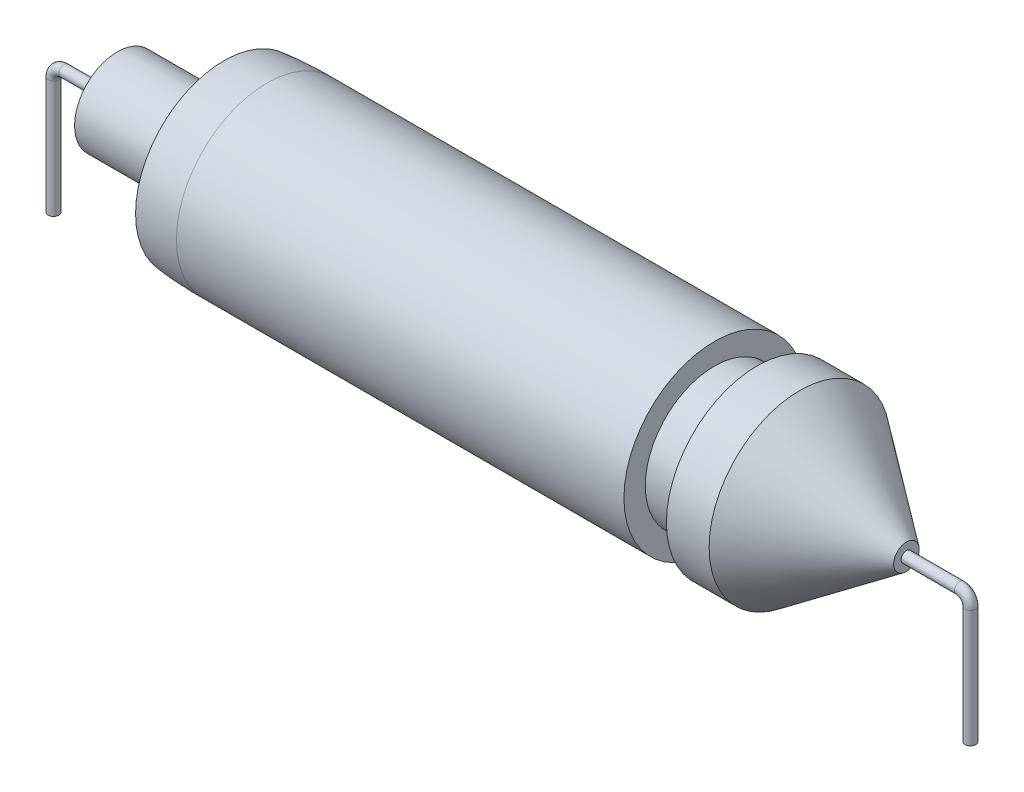
ISO-10303-21;
HEADER;
FILE_DESCRIPTION(('STEP AP214'),'2;1');
FILE_NAME('part.step','',(''),(''),'','','');
FILE_SCHEMA(('AUTOMOTIVE_DESIGN { 1 0 10303 214 1 1 1 1 }'));
ENDSEC;
DATA;
#1=APPLICATION_CONTEXT('core data for automotive mechanical design processes');
#2=APPLICATION_PROTOCOL_DEFINITION('international standard','automotive_design',2000,#1);
#3=PRODUCT_CONTEXT('',#1,'mechanical');
#4=PRODUCT('Part','Part','',(#3));
#5=PRODUCT_RELATED_PRODUCT_CATEGORY('part','',(#4));
#6=PRODUCT_DEFINITION_FORMATION('','',#4);
#7=PRODUCT_DEFINITION_CONTEXT('part definition',#1,'design');
#8=PRODUCT_DEFINITION('design','',#6,#7);
#9=PRODUCT_DEFINITION_SHAPE('','',#8);
#10=(LENGTH_UNIT() NAMED_UNIT(*) SI_UNIT(.MILLI.,.METRE.));
#11=(NAMED_UNIT(*) PLANE_ANGLE_UNIT() SI_UNIT($,.RADIAN.));
#12=(NAMED_UNIT(*) SI_UNIT($,.STERADIAN.) SOLID_ANGLE_UNIT());
#13=UNCERTAINTY_MEASURE_WITH_UNIT(LENGTH_MEASURE(1.E-05),#10,'distance_accuracy_value','');
#14=(GEOMETRIC_REPRESENTATION_CONTEXT(3) GLOBAL_UNCERTAINTY_ASSIGNED_CONTEXT((#13)) GLOBAL_UNIT_ASSIGNED_CONTEXT((#10,
#11,#12)) REPRESENTATION_CONTEXT('',''));
#15=CARTESIAN_POINT('',(0.,0.,0.));
#16=DIRECTION('',(0.,0.,1.));
#17=DIRECTION('',(1.,0.,0.));
#18=AXIS2_PLACEMENT_3D('',#15,#16,#17);
#19=CARTESIAN_POINT('',(21854.0017258238,-6000.,0.));
#20=DIRECTION('',(0.,1.,0.));
#21=DIRECTION('',(0.,0.,1.));
#22=AXIS2_PLACEMENT_3D('',#19,#20,#21);
#23=PLANE('',#22);
#24=CARTESIAN_POINT('',(21854.0017258238,-6000.,0.));
#25=DIRECTION('',(0.,1.,0.));
#26=DIRECTION('',(0.,0.,1.));
#27=AXIS2_PLACEMENT_3D('',#24,#25,#26);
#28=CIRCLE('',#27,250.);
#29=CARTESIAN_POINT('',(21854.0017258238,-6000.,250.));
#30=VERTEX_POINT('',#29);
#31=EDGE_CURVE('E67',#30,#30,#28,.T.);
#32=ORIENTED_EDGE('',*,*,#31,.F.);
#33=EDGE_LOOP('',(#32));
#34=FACE_BOUND('',#33,.T.);
#35=ADVANCED_FACE('F61',(#34),#23,.F.);
#36=CARTESIAN_POINT('',(18854.0017258238,0.,0.));
#37=DIRECTION('',(1.,0.,0.));
#38=DIRECTION('',(0.,0.,-1.));
#39=AXIS2_PLACEMENT_3D('',#36,#37,#38);
#40=CYLINDRICAL_SURFACE('',#39,250.);
#41=CARTESIAN_POINT('',(21354.0017258238,0.,0.));
#42=DIRECTION('',(-1.,0.,0.));
#43=DIRECTION('',(0.,0.,1.));
#44=AXIS2_PLACEMENT_3D('',#41,#42,#43);
#45=CIRCLE('',#44,250.);
#46=CARTESIAN_POINT('',(21354.0017258238,250.,0.));
#47=VERTEX_POINT('',#46);
#48=EDGE_CURVE('E75',#47,#47,#45,.T.);
#49=ORIENTED_EDGE('',*,*,#48,.T.);
#50=EDGE_LOOP('',(#49));
#51=FACE_BOUND('',#50,.T.);
#52=CARTESIAN_POINT('',(18854.0017258238,0.,0.));
#53=DIRECTION('',(-1.,0.,0.));
#54=DIRECTION('',(0.,0.,1.));
#55=AXIS2_PLACEMENT_3D('',#52,#53,#54);
#56=CIRCLE('',#55,250.);
#57=CARTESIAN_POINT('',(18854.0017258238,0.,250.));
#58=VERTEX_POINT('',#57);
#59=EDGE_CURVE('E80',#58,#58,#56,.T.);
#60=ORIENTED_EDGE('',*,*,#59,.F.);
#61=EDGE_LOOP('',(#60));
#62=FACE_BOUND('',#61,.T.);
#63=ADVANCED_FACE('F143',(#51,#62),#40,.T.);
#64=CARTESIAN_POINT('',(21354.0017258238,-500.,0.));
#65=DIRECTION('',(0.,0.,-1.));
#66=DIRECTION('',(-1.,0.,0.));
#67=AXIS2_PLACEMENT_3D('',#64,#65,#66);
#68=TOROIDAL_SURFACE('',#67,500.,250.);
#69=CARTESIAN_POINT('',(21854.0017258238,-500.,0.));
#70=DIRECTION('',(0.,1.,0.));
#71=DIRECTION('',(0.,0.,1.));
#72=AXIS2_PLACEMENT_3D('',#69,#70,#71);
#73=CIRCLE('',#72,250.);
#74=CARTESIAN_POINT('',(22104.0017258238,-500.,0.));
#75=VERTEX_POINT('',#74);
#76=EDGE_CURVE('E71',#75,#75,#73,.T.);
#77=CARTESIAN_POINT('',(21354.0017258238,-500.,0.));
#78=DIRECTION('',(0.,0.,-1.));
#79=DIRECTION('',(-1.,0.,0.));
#80=AXIS2_PLACEMENT_3D('',#77,#78,#79);
#81=CIRCLE('',#80,750.);
#82=EDGE_CURVE('',#47,#75,#81,.T.);
#83=ORIENTED_EDGE('',*,*,#48,.F.);
#84=ORIENTED_EDGE('',*,*,#76,.T.);
#85=ORIENTED_EDGE('',*,*,#82,.T.);
#86=ORIENTED_EDGE('',*,*,#82,.F.);
#87=EDGE_LOOP('',(#83,#85,#84,#86));
#88=FACE_BOUND('',#87,.T.);
#89=ADVANCED_FACE('F146',(#88),#68,.T.);
#90=CARTESIAN_POINT('',(21854.0017258238,-500.,0.));
#91=DIRECTION('',(0.,-1.,0.));
#92=DIRECTION('',(0.,0.,-1.));
#93=AXIS2_PLACEMENT_3D('',#90,#91,#92);
#94=CYLINDRICAL_SURFACE('',#93,250.);
#95=ORIENTED_EDGE('',*,*,#31,.T.);
#96=EDGE_LOOP('',(#95));
#97=FACE_BOUND('',#96,.T.);
#98=ORIENTED_EDGE('',*,*,#76,.F.);
#99=EDGE_LOOP('',(#98));
#100=FACE_BOUND('',#99,.T.);
#101=ADVANCED_FACE('F141',(#97,#100),#94,.T.);
#102=CARTESIAN_POINT('',(-18134.91260846,0.,0.));
#103=DIRECTION('',(1.,0.,0.));
#104=DIRECTION('',(0.,0.,-1.));
#105=AXIS2_PLACEMENT_3D('',#102,#103,#104);
#106=PLANE('',#105);
#107=CARTESIAN_POINT('',(-18134.91260846,-1.06581410364015E-11,0.));
#108=DIRECTION('',(1.,0.,0.));
#109=DIRECTION('',(0.,0.,-1.));
#110=AXIS2_PLACEMENT_3D('',#107,#108,#109);
#111=CIRCLE('',#110,250.);
#112=CARTESIAN_POINT('',(-18134.91260846,-1.06581410364015E-11,-250.));
#113=VERTEX_POINT('',#112);
#114=EDGE_CURVE('E11',#113,#113,#111,.F.);
#115=ORIENTED_EDGE('',*,*,#114,.F.);
#116=EDGE_LOOP('',(#115));
#117=FACE_BOUND('',#116,.T.);
#118=CARTESIAN_POINT('',(-18134.91260846,0.,0.));
#119=DIRECTION('',(-1.,0.,0.));
#120=DIRECTION('',(0.,0.,1.));
#121=AXIS2_PLACEMENT_3D('',#118,#119,#120);
#122=CIRCLE('',#121,2000.00000000001);
#123=CARTESIAN_POINT('',(-18134.91260846,0.,2000.00000000001));
#124=VERTEX_POINT('',#123);
#125=EDGE_CURVE('E83',#124,#124,#122,.T.);
#126=ORIENTED_EDGE('',*,*,#125,.T.);
#127=EDGE_LOOP('',(#126));
#128=FACE_BOUND('',#127,.T.);
#129=ADVANCED_FACE('F137',(#117,#128),#106,.F.);
#130=CARTESIAN_POINT('',(-24280.0396948432,0.,0.));
#131=DIRECTION('',(-1.,0.,0.));
#132=DIRECTION('',(0.,0.,1.));
#133=AXIS2_PLACEMENT_3D('',#130,#131,#132);
#134=CYLINDRICAL_SURFACE('',#133,2000.00000000001);
#135=ORIENTED_EDGE('',*,*,#125,.F.);
#136=EDGE_LOOP('',(#135));
#137=FACE_BOUND('',#136,.T.);
#138=CARTESIAN_POINT('',(-13134.91260846,0.,0.));
#139=DIRECTION('',(-1.,0.,0.));
#140=DIRECTION('',(0.,0.,1.));
#141=AXIS2_PLACEMENT_3D('',#138,#139,#140);
#142=CIRCLE('',#141,2000.00000000001);
#143=CARTESIAN_POINT('',(-13134.91260846,0.,2000.00000000001));
#144=VERTEX_POINT('',#143);
#145=EDGE_CURVE('E86',#144,#144,#142,.T.);
#146=ORIENTED_EDGE('',*,*,#145,.T.);
#147=EDGE_LOOP('',(#146));
#148=FACE_BOUND('',#147,.T.);
#149=ADVANCED_FACE('F133',(#137,#148),#134,.T.);
#150=CARTESIAN_POINT('',(-13134.91260846,0.,0.));
#151=DIRECTION('',(1.,0.,0.));
#152=DIRECTION('',(0.,0.,-1.));
#153=AXIS2_PLACEMENT_3D('',#150,#151,#152);
#154=PLANE('',#153);
#155=ORIENTED_EDGE('',*,*,#145,.F.);
#156=EDGE_LOOP('',(#155));
#157=FACE_BOUND('',#156,.T.);
#158=CARTESIAN_POINT('',(-13134.91260846,0.,0.));
#159=DIRECTION('',(-1.,0.,0.));
#160=DIRECTION('',(0.,0.,1.));
#161=AXIS2_PLACEMENT_3D('',#158,#159,#160);
#162=CIRCLE('',#161,4141.95144937075);
#163=CARTESIAN_POINT('',(-13134.91260846,0.,4141.95144937075));
#164=VERTEX_POINT('',#163);
#165=EDGE_CURVE('E89',#164,#164,#162,.T.);
#166=ORIENTED_EDGE('',*,*,#165,.T.);
#167=EDGE_LOOP('',(#166));
#168=FACE_BOUND('',#167,.T.);
#169=ADVANCED_FACE('F128',(#157,#168),#154,.F.);
#170=CARTESIAN_POINT('',(-11120.5684342435,0.,4241.4538927148));
#171=CARTESIAN_POINT('',(-12129.4259673114,0.,4249.9871215852));
#172=CARTESIAN_POINT('',(-13134.91260846,0.,4141.95144937075));
#173=B_SPLINE_CURVE_WITH_KNOTS('',2,(#170,#171,#172),.UNSPECIFIED.,.F.,.F.,(3,3),(0.,1.),.UNSPECIFIED.);
#174=CARTESIAN_POINT('',(-24280.0396948432,0.,0.));
#175=DIRECTION('',(-1.,0.,0.));
#176=AXIS1_PLACEMENT('',#174,#175);
#177=SURFACE_OF_REVOLUTION('',#173,#176);
#178=ORIENTED_EDGE('',*,*,#165,.F.);
#179=EDGE_LOOP('',(#178));
#180=FACE_BOUND('',#179,.T.);
#181=CARTESIAN_POINT('',(-11120.5684342435,0.,0.));
#182=DIRECTION('',(-1.,0.,0.));
#183=DIRECTION('',(0.,0.,1.));
#184=AXIS2_PLACEMENT_3D('',#181,#182,#183);
#185=CIRCLE('',#184,4241.4538927148);
#186=CARTESIAN_POINT('',(-11120.5684342435,0.,4241.4538927148));
#187=VERTEX_POINT('',#186);
#188=EDGE_CURVE('E92',#187,#187,#185,.T.);
#189=ORIENTED_EDGE('',*,*,#188,.T.);
#190=EDGE_LOOP('',(#189));
#191=FACE_BOUND('',#190,.T.);
#192=ADVANCED_FACE('F123',(#180,#191),#177,.T.);
#193=CARTESIAN_POINT('',(-24280.0396948432,0.,0.));
#194=DIRECTION('',(-1.,0.,0.));
#195=DIRECTION('',(0.,0.,1.));
#196=AXIS2_PLACEMENT_3D('',#193,#194,#195);
#197=CYLINDRICAL_SURFACE('',#196,4241.4538927148);
#198=CARTESIAN_POINT('',(9854.00172582376,0.,0.));
#199=DIRECTION('',(-1.,0.,0.));
#200=DIRECTION('',(0.,0.,1.));
#201=AXIS2_PLACEMENT_3D('',#198,#199,#200);
#202=CIRCLE('',#201,4241.4538927148);
#203=CARTESIAN_POINT('',(9854.00172582376,0.,4241.4538927148));
#204=VERTEX_POINT('',#203);
#205=EDGE_CURVE('E95',#204,#204,#202,.T.);
#206=ORIENTED_EDGE('',*,*,#205,.T.);
#207=EDGE_LOOP('',(#206));
#208=FACE_BOUND('',#207,.T.);
#209=ORIENTED_EDGE('',*,*,#188,.F.);
#210=EDGE_LOOP('',(#209));
#211=FACE_BOUND('',#210,.T.);
#212=ADVANCED_FACE('F127',(#208,#211),#197,.T.);
#213=CARTESIAN_POINT('',(9854.00172582376,0.,0.));
#214=DIRECTION('',(1.,0.,0.));
#215=DIRECTION('',(0.,0.,-1.));
#216=AXIS2_PLACEMENT_3D('',#213,#214,#215);
#217=PLANE('',#216);
#218=CARTESIAN_POINT('',(9854.00172582376,0.,0.));
#219=DIRECTION('',(-1.,0.,0.));
#220=DIRECTION('',(0.,0.,1.));
#221=AXIS2_PLACEMENT_3D('',#218,#219,#220);
#222=CIRCLE('',#221,3241.4538927148);
#223=CARTESIAN_POINT('',(9854.00172582376,0.,3241.4538927148));
#224=VERTEX_POINT('',#223);
#225=EDGE_CURVE('E98',#224,#224,#222,.T.);
#226=ORIENTED_EDGE('',*,*,#225,.T.);
#227=EDGE_LOOP('',(#226));
#228=FACE_BOUND('',#227,.T.);
#229=ORIENTED_EDGE('',*,*,#205,.F.);
#230=EDGE_LOOP('',(#229));
#231=FACE_BOUND('',#230,.T.);
#232=ADVANCED_FACE('F188',(#228,#231),#217,.T.);
#233=CARTESIAN_POINT('',(-24280.0396948432,0.,0.));
#234=DIRECTION('',(-1.,0.,0.));
#235=DIRECTION('',(0.,0.,1.));
#236=AXIS2_PLACEMENT_3D('',#233,#234,#235);
#237=CYLINDRICAL_SURFACE('',#236,3241.4538927148);
#238=CARTESIAN_POINT('',(11854.0017258238,0.,0.));
#239=DIRECTION('',(-1.,0.,0.));
#240=DIRECTION('',(0.,0.,1.));
#241=AXIS2_PLACEMENT_3D('',#238,#239,#240);
#242=CIRCLE('',#241,3241.4538927148);
#243=CARTESIAN_POINT('',(11854.0017258238,0.,3241.4538927148));
#244=VERTEX_POINT('',#243);
#245=EDGE_CURVE('E101',#244,#244,#242,.T.);
#246=ORIENTED_EDGE('',*,*,#245,.T.);
#247=EDGE_LOOP('',(#246));
#248=FACE_BOUND('',#247,.T.);
#249=ORIENTED_EDGE('',*,*,#225,.F.);
#250=EDGE_LOOP('',(#249));
#251=FACE_BOUND('',#250,.T.);
#252=ADVANCED_FACE('F182',(#248,#251),#237,.T.);
#253=CARTESIAN_POINT('',(11854.0017258238,0.,0.));
#254=DIRECTION('',(1.,0.,0.));
#255=DIRECTION('',(0.,0.,-1.));
#256=AXIS2_PLACEMENT_3D('',#253,#254,#255);
#257=PLANE('',#256);
#258=ORIENTED_EDGE('',*,*,#245,.F.);
#259=EDGE_LOOP('',(#258));
#260=FACE_BOUND('',#259,.T.);
#261=CARTESIAN_POINT('',(11854.0017258238,0.,0.));
#262=DIRECTION('',(-1.,0.,0.));
#263=DIRECTION('',(0.,0.,1.));
#264=AXIS2_PLACEMENT_3D('',#261,#262,#263);
#265=CIRCLE('',#264,4250.);
#266=CARTESIAN_POINT('',(11854.0017258238,0.,4250.));
#267=VERTEX_POINT('',#266);
#268=EDGE_CURVE('E104',#267,#267,#265,.T.);
#269=ORIENTED_EDGE('',*,*,#268,.T.);
#270=EDGE_LOOP('',(#269));
#271=FACE_BOUND('',#270,.T.);
#272=ADVANCED_FACE('F177',(#260,#271),#257,.F.);
#273=CARTESIAN_POINT('',(-24280.0396948432,0.,0.));
#274=DIRECTION('',(-1.,0.,0.));
#275=DIRECTION('',(0.,0.,1.));
#276=AXIS2_PLACEMENT_3D('',#273,#274,#275);
#277=CYLINDRICAL_SURFACE('',#276,4250.);
#278=CARTESIAN_POINT('',(13854.0017258238,0.,0.));
#279=DIRECTION('',(-1.,0.,0.));
#280=DIRECTION('',(0.,0.,1.));
#281=AXIS2_PLACEMENT_3D('',#278,#279,#280);
#282=CIRCLE('',#281,4250.);
#283=CARTESIAN_POINT('',(13854.0017258238,0.,4250.));
#284=VERTEX_POINT('',#283);
#285=EDGE_CURVE('E107',#284,#284,#282,.T.);
#286=ORIENTED_EDGE('',*,*,#285,.T.);
#287=EDGE_LOOP('',(#286));
#288=FACE_BOUND('',#287,.T.);
#289=ORIENTED_EDGE('',*,*,#268,.F.);
#290=EDGE_LOOP('',(#289));
#291=FACE_BOUND('',#290,.T.);
#292=ADVANCED_FACE('F171',(#288,#291),#277,.T.);
#293=CARTESIAN_POINT('',(13854.0017258238,0.,0.));
#294=DIRECTION('',(-1.,0.,0.));
#295=DIRECTION('',(0.,0.,1.));
#296=AXIS2_PLACEMENT_3D('',#293,#294,#295);
#297=CONICAL_SURFACE('',#296,4250.,0.630577757214935);
#298=CARTESIAN_POINT('',(18854.0017258238,0.,0.));
#299=DIRECTION('',(-1.,0.,0.));
#300=DIRECTION('',(0.,0.,1.));
#301=AXIS2_PLACEMENT_3D('',#298,#299,#300);
#302=CIRCLE('',#301,600.);
#303=CARTESIAN_POINT('',(18854.0017258238,0.,600.));
#304=VERTEX_POINT('',#303);
#305=EDGE_CURVE('E110',#304,#304,#302,.T.);
#306=ORIENTED_EDGE('',*,*,#305,.T.);
#307=EDGE_LOOP('',(#306));
#308=FACE_BOUND('',#307,.T.);
#309=ORIENTED_EDGE('',*,*,#285,.F.);
#310=EDGE_LOOP('',(#309));
#311=FACE_BOUND('',#310,.T.);
#312=ADVANCED_FACE('F164',(#308,#311),#297,.T.);
#313=CARTESIAN_POINT('',(18854.0017258238,0.,1.11638116385771E-10));
#314=DIRECTION('',(1.,0.,0.));
#315=DIRECTION('',(0.,0.,-1.));
#316=AXIS2_PLACEMENT_3D('',#313,#314,#315);
#317=PLANE('',#316);
#318=ORIENTED_EDGE('',*,*,#59,.T.);
#319=EDGE_LOOP('',(#318));
#320=FACE_BOUND('',#319,.T.);
#321=ORIENTED_EDGE('',*,*,#305,.F.);
#322=EDGE_LOOP('',(#321));
#323=FACE_BOUND('',#322,.T.);
#324=ADVANCED_FACE('F160',(#320,#323),#317,.T.);
#325=CARTESIAN_POINT('',(-21121.5868063398,-6000.,0.));
#326=DIRECTION('',(0.,1.,0.));
#327=DIRECTION('',(0.,0.,1.));
#328=AXIS2_PLACEMENT_3D('',#325,#326,#327);
#329=PLANE('',#328);
#330=CARTESIAN_POINT('',(-21121.5868063398,-6000.,0.));
#331=DIRECTION('',(0.,1.,0.));
#332=DIRECTION('',(0.,0.,1.));
#333=AXIS2_PLACEMENT_3D('',#330,#331,#332);
#334=CIRCLE('',#333,250.);
#335=CARTESIAN_POINT('',(-21121.5868063398,-6000.,250.));
#336=VERTEX_POINT('',#335);
#337=EDGE_CURVE('E113',#336,#336,#334,.T.);
#338=ORIENTED_EDGE('',*,*,#337,.F.);
#339=EDGE_LOOP('',(#338));
#340=FACE_BOUND('',#339,.T.);
#341=ADVANCED_FACE('F163',(#340),#329,.F.);
#342=CARTESIAN_POINT('',(-18134.91260846,-1.06581410364015E-11,0.));
#343=DIRECTION('',(-1.,0.,0.));
#344=DIRECTION('',(0.,0.,1.));
#345=AXIS2_PLACEMENT_3D('',#342,#343,#344);
#346=CYLINDRICAL_SURFACE('',#345,250.);
#347=CARTESIAN_POINT('',(-20621.5868063398,-1.06581410364015E-11,0.));
#348=DIRECTION('',(1.,0.,0.));
#349=DIRECTION('',(0.,0.,1.));
#350=AXIS2_PLACEMENT_3D('',#347,#348,#349);
#351=CIRCLE('',#350,250.);
#352=CARTESIAN_POINT('',(-20621.5868063398,249.999999999989,0.));
#353=VERTEX_POINT('',#352);
#354=EDGE_CURVE('E341',#353,#353,#351,.T.);
#355=ORIENTED_EDGE('',*,*,#354,.T.);
#356=EDGE_LOOP('',(#355));
#357=FACE_BOUND('',#356,.T.);
#358=ORIENTED_EDGE('',*,*,#114,.T.);
#359=EDGE_LOOP('',(#358));
#360=FACE_BOUND('',#359,.T.);
#361=ADVANCED_FACE('F258',(#357,#360),#346,.T.);
#362=CARTESIAN_POINT('',(-20621.5868063398,-500.000000000009,0.));
#363=DIRECTION('',(0.,0.,1.));
#364=DIRECTION('',(1.,0.,0.));
#365=AXIS2_PLACEMENT_3D('',#362,#363,#364);
#366=TOROIDAL_SURFACE('',#365,499.999999999998,250.);
#367=CARTESIAN_POINT('',(-21121.5868063398,-500.000000000009,0.));
#368=DIRECTION('',(0.,1.,0.));
#369=DIRECTION('',(0.,0.,1.));
#370=AXIS2_PLACEMENT_3D('',#367,#368,#369);
#371=CIRCLE('',#370,250.);
#372=CARTESIAN_POINT('',(-21371.5868063398,-500.000000000009,0.));
#373=VERTEX_POINT('',#372);
#374=EDGE_CURVE('E340',#373,#373,#371,.T.);
#375=CARTESIAN_POINT('',(-20621.5868063398,-500.000000000009,0.));
#376=DIRECTION('',(0.,0.,1.));
#377=DIRECTION('',(1.,0.,0.));
#378=AXIS2_PLACEMENT_3D('',#375,#376,#377);
#379=CIRCLE('',#378,749.999999999998);
#380=EDGE_CURVE('',#353,#373,#379,.T.);
#381=ORIENTED_EDGE('',*,*,#354,.F.);
#382=ORIENTED_EDGE('',*,*,#374,.T.);
#383=ORIENTED_EDGE('',*,*,#380,.T.);
#384=ORIENTED_EDGE('',*,*,#380,.F.);
#385=EDGE_LOOP('',(#381,#383,#382,#384));
#386=FACE_BOUND('',#385,.T.);
#387=ADVANCED_FACE('F268',(#386),#366,.T.);
#388=CARTESIAN_POINT('',(-21121.5868063398,-500.000000000009,0.));
#389=DIRECTION('',(0.,-1.,0.));
#390=DIRECTION('',(0.,0.,-1.));
#391=AXIS2_PLACEMENT_3D('',#388,#389,#390);
#392=CYLINDRICAL_SURFACE('',#391,250.);
#393=ORIENTED_EDGE('',*,*,#337,.T.);
#394=EDGE_LOOP('',(#393));
#395=FACE_BOUND('',#394,.T.);
#396=ORIENTED_EDGE('',*,*,#374,.F.);
#397=EDGE_LOOP('',(#396));
#398=FACE_BOUND('',#397,.T.);
#399=ADVANCED_FACE('F166',(#395,#398),#392,.T.);
#400=CLOSED_SHELL('',(#35,#63,#89,#101,#129,#149,#169,#192,#212,#232,#252,#272,#292,#312,#324,
#341,#361,#387,#399));
#401=MANIFOLD_SOLID_BREP('B2',#400);
#402=ADVANCED_BREP_SHAPE_REPRESENTATION('',(#18,#401),#14);
#403=SHAPE_DEFINITION_REPRESENTATION(#9,#402);
ENDSEC;
END-ISO-10303-21;
